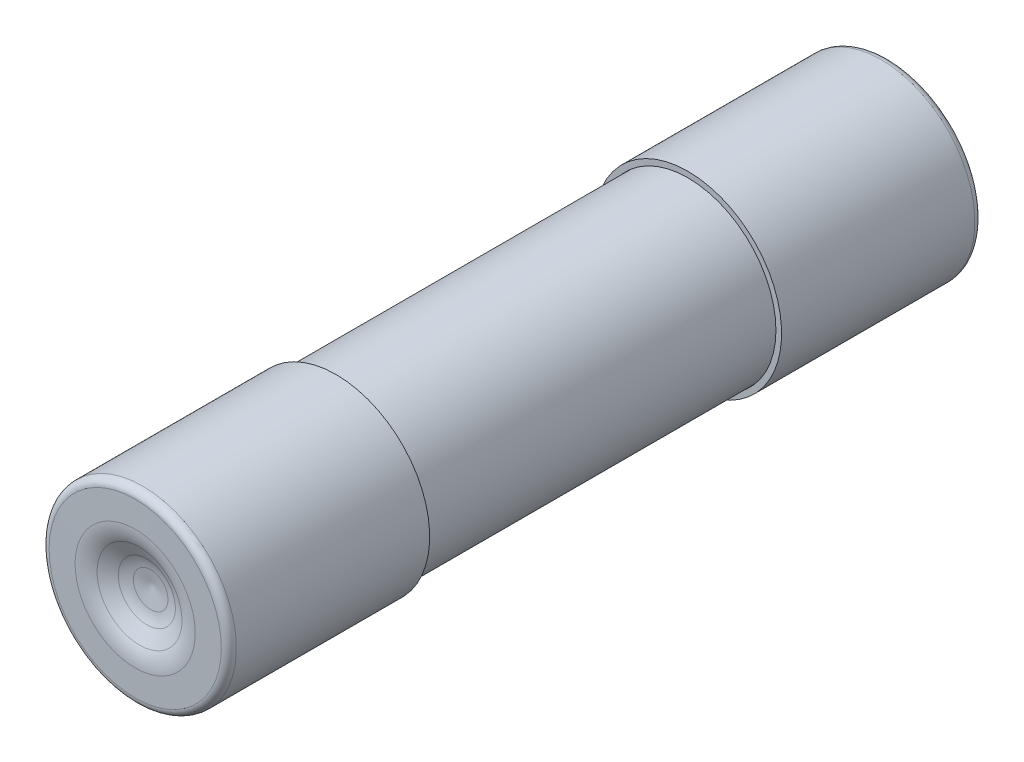
ISO-10303-21;
HEADER;
FILE_DESCRIPTION(('STEP AP214'),'2;1');
FILE_NAME('part.step','',(''),(''),'','','');
FILE_SCHEMA(('AUTOMOTIVE_DESIGN { 1 0 10303 214 1 1 1 1 }'));
ENDSEC;
DATA;
#1=APPLICATION_CONTEXT('core data for automotive mechanical design processes');
#2=APPLICATION_PROTOCOL_DEFINITION('international standard','automotive_design',2000,#1);
#3=PRODUCT_CONTEXT('',#1,'mechanical');
#4=PRODUCT('Part','Part','',(#3));
#5=PRODUCT_RELATED_PRODUCT_CATEGORY('part','',(#4));
#6=PRODUCT_DEFINITION_FORMATION('','',#4);
#7=PRODUCT_DEFINITION_CONTEXT('part definition',#1,'design');
#8=PRODUCT_DEFINITION('design','',#6,#7);
#9=PRODUCT_DEFINITION_SHAPE('','',#8);
#10=(LENGTH_UNIT() NAMED_UNIT(*) SI_UNIT(.MILLI.,.METRE.));
#11=(NAMED_UNIT(*) PLANE_ANGLE_UNIT() SI_UNIT($,.RADIAN.));
#12=(NAMED_UNIT(*) SI_UNIT($,.STERADIAN.) SOLID_ANGLE_UNIT());
#13=UNCERTAINTY_MEASURE_WITH_UNIT(LENGTH_MEASURE(1.E-05),#10,'distance_accuracy_value','');
#14=(GEOMETRIC_REPRESENTATION_CONTEXT(3) GLOBAL_UNCERTAINTY_ASSIGNED_CONTEXT((#13)) GLOBAL_UNIT_ASSIGNED_CONTEXT((#10,
#11,#12)) REPRESENTATION_CONTEXT('',''));
#15=CARTESIAN_POINT('',(0.,0.,0.));
#16=DIRECTION('',(0.,0.,1.));
#17=DIRECTION('',(1.,0.,0.));
#18=AXIS2_PLACEMENT_3D('',#15,#16,#17);
#19=CARTESIAN_POINT('',(0.,0.,19.3801475961462));
#20=DIRECTION('',(0.,0.,1.));
#21=DIRECTION('',(0.,-1.,0.));
#22=AXIS2_PLACEMENT_3D('',#19,#20,#21);
#23=DEGENERATE_TOROIDAL_SURFACE('',#22,0.0349351201433466,1.,.T.);
#24=CARTESIAN_POINT('',(0.,0.,18.3943292370881));
#25=DIRECTION('',(0.,0.,1.));
#26=DIRECTION('',(0.,-1.,0.));
#27=AXIS2_PLACEMENT_3D('',#24,#25,#26);
#28=CIRCLE('',#27,0.202750980371087);
#29=CARTESIAN_POINT('',(0.,-0.202750980371087,18.3943292370881));
#30=VERTEX_POINT('',#29);
#31=EDGE_CURVE('E12',#30,#30,#28,.T.);
#32=ORIENTED_EDGE('',*,*,#31,.F.);
#33=EDGE_LOOP('',(#32));
#34=FACE_BOUND('',#33,.T.);
#35=CARTESIAN_POINT('',(0.,0.,18.3801475961462));
#36=DIRECTION('',(0.,0.,1.));
#37=DIRECTION('',(0.,-1.,0.));
#38=AXIS2_PLACEMENT_3D('',#35,#36,#37);
#39=CIRCLE('',#38,0.0349351201433437);
#40=CARTESIAN_POINT('',(0.,-0.0349351201433436,18.3801475961462));
#41=VERTEX_POINT('',#40);
#42=EDGE_CURVE('E65',#41,#41,#39,.T.);
#43=ORIENTED_EDGE('',*,*,#42,.T.);
#44=EDGE_LOOP('',(#43));
#45=FACE_BOUND('',#44,.T.);
#46=ADVANCED_FACE('F45',(#34,#45),#23,.T.);
#47=CARTESIAN_POINT('',(0.,0.,18.3943292370881));
#48=DIRECTION('',(0.,0.,1.));
#49=DIRECTION('',(0.,-1.,0.));
#50=AXIS2_PLACEMENT_3D('',#47,#48,#49);
#51=CONICAL_SURFACE('',#50,0.202750980371087,1.40218263749149);
#52=CARTESIAN_POINT('',(0.,0.,18.4463330154933));
#53=DIRECTION('',(0.,0.,1.));
#54=DIRECTION('',(0.,-1.,0.));
#55=AXIS2_PLACEMENT_3D('',#52,#53,#54);
#56=CIRCLE('',#55,0.508242245753945);
#57=CARTESIAN_POINT('',(0.,-0.508242245753945,18.4463330154933));
#58=VERTEX_POINT('',#57);
#59=EDGE_CURVE('E51',#58,#58,#56,.T.);
#60=ORIENTED_EDGE('',*,*,#59,.F.);
#61=EDGE_LOOP('',(#60));
#62=FACE_BOUND('',#61,.T.);
#63=ORIENTED_EDGE('',*,*,#31,.T.);
#64=EDGE_LOOP('',(#63));
#65=FACE_BOUND('',#64,.T.);
#66=ADVANCED_FACE('F109',(#62,#65),#51,.T.);
#67=CARTESIAN_POINT('',(0.,0.,19.4321513745514));
#68=DIRECTION('',(0.,0.,1.));
#69=DIRECTION('',(0.,-1.,0.));
#70=AXIS2_PLACEMENT_3D('',#67,#68,#69);
#71=DEGENERATE_TOROIDAL_SURFACE('',#70,0.34042638552621,1.,.T.);
#72=CARTESIAN_POINT('',(0.,0.,18.5473246046598));
#73=DIRECTION('',(0.,0.,1.));
#74=DIRECTION('',(0.,-1.,0.));
#75=AXIS2_PLACEMENT_3D('',#72,#73,#74);
#76=CIRCLE('',#75,0.806346536714317);
#77=CARTESIAN_POINT('',(0.,-0.806346536714317,18.5473246046598));
#78=VERTEX_POINT('',#77);
#79=EDGE_CURVE('E102',#78,#78,#76,.T.);
#80=ORIENTED_EDGE('',*,*,#79,.F.);
#81=EDGE_LOOP('',(#80));
#82=FACE_BOUND('',#81,.T.);
#83=ORIENTED_EDGE('',*,*,#59,.T.);
#84=EDGE_LOOP('',(#83));
#85=FACE_BOUND('',#84,.T.);
#86=ADVANCED_FACE('F107',(#82,#85),#71,.T.);
#87=CARTESIAN_POINT('',(0.,0.,18.5473246046598));
#88=DIRECTION('',(0.,0.,1.));
#89=DIRECTION('',(0.,-1.,0.));
#90=AXIS2_PLACEMENT_3D('',#87,#88,#89);
#91=CONICAL_SURFACE('',#90,0.806346536714317,1.08612207754713);
#92=CARTESIAN_POINT('',(0.,0.,18.7348267698916));
#93=DIRECTION('',(0.,0.,1.));
#94=DIRECTION('',(0.,-1.,0.));
#95=AXIS2_PLACEMENT_3D('',#92,#93,#94);
#96=CIRCLE('',#95,1.16243101768532);
#97=CARTESIAN_POINT('',(0.,-1.16243101768532,18.7348267698916));
#98=VERTEX_POINT('',#97);
#99=EDGE_CURVE('E99',#98,#98,#96,.T.);
#100=ORIENTED_EDGE('',*,*,#99,.F.);
#101=EDGE_LOOP('',(#100));
#102=FACE_BOUND('',#101,.T.);
#103=ORIENTED_EDGE('',*,*,#79,.T.);
#104=EDGE_LOOP('',(#103));
#105=FACE_BOUND('',#104,.T.);
#106=ADVANCED_FACE('F164',(#102,#105),#91,.T.);
#107=CARTESIAN_POINT('',(0.,0.,17.85));
#108=DIRECTION('',(0.,0.,1.));
#109=DIRECTION('',(0.,-1.,0.));
#110=AXIS2_PLACEMENT_3D('',#107,#108,#109);
#111=TOROIDAL_SURFACE('',#110,1.62835116887342,0.999999999999997);
#112=CARTESIAN_POINT('',(0.,0.,18.85));
#113=DIRECTION('',(0.,0.,1.));
#114=DIRECTION('',(0.,-1.,0.));
#115=AXIS2_PLACEMENT_3D('',#112,#113,#114);
#116=CIRCLE('',#115,1.62835116887343);
#117=CARTESIAN_POINT('',(0.,-1.62835116887343,18.85));
#118=VERTEX_POINT('',#117);
#119=EDGE_CURVE('E96',#118,#118,#116,.T.);
#120=ORIENTED_EDGE('',*,*,#119,.F.);
#121=EDGE_LOOP('',(#120));
#122=FACE_BOUND('',#121,.T.);
#123=ORIENTED_EDGE('',*,*,#99,.T.);
#124=EDGE_LOOP('',(#123));
#125=FACE_BOUND('',#124,.T.);
#126=ADVANCED_FACE('F160',(#122,#125),#111,.F.);
#127=CARTESIAN_POINT('',(0.,2.285,18.85));
#128=DIRECTION('',(0.,0.,1.));
#129=DIRECTION('',(0.,-1.,0.));
#130=AXIS2_PLACEMENT_3D('',#127,#128,#129);
#131=PLANE('',#130);
#132=CARTESIAN_POINT('',(0.,0.,18.85));
#133=DIRECTION('',(0.,0.,1.));
#134=DIRECTION('',(0.,-1.,0.));
#135=AXIS2_PLACEMENT_3D('',#132,#133,#134);
#136=CIRCLE('',#135,2.285);
#137=CARTESIAN_POINT('',(0.,-2.285,18.85));
#138=VERTEX_POINT('',#137);
#139=EDGE_CURVE('E93',#138,#138,#136,.T.);
#140=ORIENTED_EDGE('',*,*,#139,.F.);
#141=EDGE_LOOP('',(#140));
#142=FACE_BOUND('',#141,.T.);
#143=ORIENTED_EDGE('',*,*,#119,.T.);
#144=EDGE_LOOP('',(#143));
#145=FACE_BOUND('',#144,.T.);
#146=ADVANCED_FACE('F156',(#142,#145),#131,.F.);
#147=CARTESIAN_POINT('',(0.,0.,18.8));
#148=DIRECTION('',(0.,0.,1.));
#149=DIRECTION('',(0.,-1.,0.));
#150=AXIS2_PLACEMENT_3D('',#147,#148,#149);
#151=TOROIDAL_SURFACE('',#150,2.285,0.049999999999999);
#152=CARTESIAN_POINT('',(0.,0.,18.8));
#153=DIRECTION('',(0.,0.,1.));
#154=DIRECTION('',(0.,-1.,0.));
#155=AXIS2_PLACEMENT_3D('',#152,#153,#154);
#156=CIRCLE('',#155,2.335);
#157=CARTESIAN_POINT('',(0.,-2.335,18.8));
#158=VERTEX_POINT('',#157);
#159=EDGE_CURVE('E90',#158,#158,#156,.T.);
#160=ORIENTED_EDGE('',*,*,#159,.F.);
#161=EDGE_LOOP('',(#160));
#162=FACE_BOUND('',#161,.T.);
#163=ORIENTED_EDGE('',*,*,#139,.T.);
#164=EDGE_LOOP('',(#163));
#165=FACE_BOUND('',#164,.T.);
#166=ADVANCED_FACE('F152',(#162,#165),#151,.F.);
#167=CARTESIAN_POINT('',(0.,0.,19.5807429338047));
#168=DIRECTION('',(0.,0.,1.));
#169=DIRECTION('',(0.,-1.,0.));
#170=AXIS2_PLACEMENT_3D('',#167,#168,#169);
#171=CYLINDRICAL_SURFACE('',#170,2.335);
#172=CARTESIAN_POINT('',(0.,0.,13.67));
#173=DIRECTION('',(0.,0.,1.));
#174=DIRECTION('',(0.,-1.,0.));
#175=AXIS2_PLACEMENT_3D('',#172,#173,#174);
#176=CIRCLE('',#175,2.335);
#177=CARTESIAN_POINT('',(0.,-2.335,13.67));
#178=VERTEX_POINT('',#177);
#179=EDGE_CURVE('E87',#178,#178,#176,.T.);
#180=ORIENTED_EDGE('',*,*,#179,.F.);
#181=EDGE_LOOP('',(#180));
#182=FACE_BOUND('',#181,.T.);
#183=ORIENTED_EDGE('',*,*,#159,.T.);
#184=EDGE_LOOP('',(#183));
#185=FACE_BOUND('',#184,.T.);
#186=ADVANCED_FACE('F148',(#182,#185),#171,.F.);
#187=CARTESIAN_POINT('',(0.,2.485,13.67));
#188=DIRECTION('',(0.,0.,1.));
#189=DIRECTION('',(0.,-1.,0.));
#190=AXIS2_PLACEMENT_3D('',#187,#188,#189);
#191=PLANE('',#190);
#192=CARTESIAN_POINT('',(0.,0.,13.67));
#193=DIRECTION('',(0.,0.,1.));
#194=DIRECTION('',(0.,-1.,0.));
#195=AXIS2_PLACEMENT_3D('',#192,#193,#194);
#196=CIRCLE('',#195,2.485);
#197=CARTESIAN_POINT('',(0.,-2.485,13.67));
#198=VERTEX_POINT('',#197);
#199=EDGE_CURVE('E84',#198,#198,#196,.T.);
#200=ORIENTED_EDGE('',*,*,#199,.F.);
#201=EDGE_LOOP('',(#200));
#202=FACE_BOUND('',#201,.T.);
#203=ORIENTED_EDGE('',*,*,#179,.T.);
#204=EDGE_LOOP('',(#203));
#205=FACE_BOUND('',#204,.T.);
#206=ADVANCED_FACE('F144',(#202,#205),#191,.F.);
#207=CARTESIAN_POINT('',(0.,0.,19.5807429338047));
#208=DIRECTION('',(0.,0.,1.));
#209=DIRECTION('',(0.,-1.,0.));
#210=AXIS2_PLACEMENT_3D('',#207,#208,#209);
#211=CYLINDRICAL_SURFACE('',#210,2.48499999999736);
#212=CARTESIAN_POINT('',(0.,0.,18.8));
#213=DIRECTION('',(0.,0.,1.));
#214=DIRECTION('',(0.,-1.,0.));
#215=AXIS2_PLACEMENT_3D('',#212,#213,#214);
#216=CIRCLE('',#215,2.48499999999471);
#217=CARTESIAN_POINT('',(0.,-2.48499999999471,18.8));
#218=VERTEX_POINT('',#217);
#219=EDGE_CURVE('E81',#218,#218,#216,.T.);
#220=ORIENTED_EDGE('',*,*,#219,.F.);
#221=EDGE_LOOP('',(#220));
#222=FACE_BOUND('',#221,.T.);
#223=ORIENTED_EDGE('',*,*,#199,.T.);
#224=EDGE_LOOP('',(#223));
#225=FACE_BOUND('',#224,.T.);
#226=ADVANCED_FACE('F140',(#222,#225),#211,.T.);
#227=CARTESIAN_POINT('',(0.,0.,18.8));
#228=DIRECTION('',(0.,0.,1.));
#229=DIRECTION('',(0.,-1.,0.));
#230=AXIS2_PLACEMENT_3D('',#227,#228,#229);
#231=TOROIDAL_SURFACE('',#230,2.285,0.199999999994713);
#232=CARTESIAN_POINT('',(0.,0.,18.9999997743625));
#233=DIRECTION('',(0.,0.,1.));
#234=DIRECTION('',(0.,-1.,0.));
#235=AXIS2_PLACEMENT_3D('',#232,#233,#234);
#236=CIRCLE('',#235,2.28530042459849);
#237=CARTESIAN_POINT('',(0.,-2.28530042459849,18.9999997743625));
#238=VERTEX_POINT('',#237);
#239=EDGE_CURVE('E78',#238,#238,#236,.T.);
#240=ORIENTED_EDGE('',*,*,#239,.F.);
#241=EDGE_LOOP('',(#240));
#242=FACE_BOUND('',#241,.T.);
#243=ORIENTED_EDGE('',*,*,#219,.T.);
#244=EDGE_LOOP('',(#243));
#245=FACE_BOUND('',#244,.T.);
#246=ADVANCED_FACE('F136',(#242,#245),#231,.T.);
#247=CARTESIAN_POINT('',(0.,0.,18.9999997743625));
#248=DIRECTION('',(0.,0.,-1.));
#249=DIRECTION('',(0.,1.,0.));
#250=AXIS2_PLACEMENT_3D('',#247,#248,#249);
#251=CONICAL_SURFACE('',#250,2.28530042459849,1.56929420318464);
#252=CARTESIAN_POINT('',(0.,0.,19.0010370737667));
#253=DIRECTION('',(0.,0.,1.));
#254=DIRECTION('',(0.,-1.,0.));
#255=AXIS2_PLACEMENT_3D('',#252,#253,#254);
#256=CIRCLE('',#255,1.59474565471326);
#257=CARTESIAN_POINT('',(0.,-1.59474565471326,19.0010370737667));
#258=VERTEX_POINT('',#257);
#259=EDGE_CURVE('E75',#258,#258,#256,.T.);
#260=ORIENTED_EDGE('',*,*,#259,.F.);
#261=EDGE_LOOP('',(#260));
#262=FACE_BOUND('',#261,.T.);
#263=ORIENTED_EDGE('',*,*,#239,.T.);
#264=EDGE_LOOP('',(#263));
#265=FACE_BOUND('',#264,.T.);
#266=ADVANCED_FACE('F132',(#262,#265),#251,.T.);
#267=CARTESIAN_POINT('',(0.,0.,18.0010382019542));
#268=DIRECTION('',(0.,0.,1.));
#269=DIRECTION('',(0.,-1.,0.));
#270=AXIS2_PLACEMENT_3D('',#267,#268,#269);
#271=TOROIDAL_SURFACE('',#270,1.5932435316679,1.);
#272=CARTESIAN_POINT('',(0.,0.,18.8858649718458));
#273=DIRECTION('',(0.,0.,1.));
#274=DIRECTION('',(0.,-1.,0.));
#275=AXIS2_PLACEMENT_3D('',#272,#273,#274);
#276=CIRCLE('',#275,1.1273233804798);
#277=CARTESIAN_POINT('',(0.,-1.1273233804798,18.8858649718458));
#278=VERTEX_POINT('',#277);
#279=EDGE_CURVE('E68',#278,#278,#276,.T.);
#280=ORIENTED_EDGE('',*,*,#279,.F.);
#281=EDGE_LOOP('',(#280));
#282=FACE_BOUND('',#281,.T.);
#283=ORIENTED_EDGE('',*,*,#259,.T.);
#284=EDGE_LOOP('',(#283));
#285=FACE_BOUND('',#284,.T.);
#286=ADVANCED_FACE('F128',(#282,#285),#271,.T.);
#287=CARTESIAN_POINT('',(0.,0.,18.8858649718458));
#288=DIRECTION('',(0.,0.,1.));
#289=DIRECTION('',(0.,-1.,0.));
#290=AXIS2_PLACEMENT_3D('',#287,#288,#289);
#291=CONICAL_SURFACE('',#290,1.1273233804798,1.08612207754713);
#292=CARTESIAN_POINT('',(0.,0.,18.6911859112977));
#293=DIRECTION('',(0.,0.,1.));
#294=DIRECTION('',(0.,-1.,0.));
#295=AXIS2_PLACEMENT_3D('',#292,#293,#294);
#296=CIRCLE('',#295,0.757609291335807);
#297=CARTESIAN_POINT('',(0.,-0.757609291335807,18.6911859112977));
#298=VERTEX_POINT('',#297);
#299=EDGE_CURVE('E64',#298,#298,#296,.T.);
#300=ORIENTED_EDGE('',*,*,#299,.F.);
#301=EDGE_LOOP('',(#300));
#302=FACE_BOUND('',#301,.T.);
#303=ORIENTED_EDGE('',*,*,#279,.T.);
#304=EDGE_LOOP('',(#303));
#305=FACE_BOUND('',#304,.T.);
#306=ADVANCED_FACE('F125',(#302,#305),#291,.F.);
#307=CARTESIAN_POINT('',(0.,0.,19.5760126811893));
#308=DIRECTION('',(0.,0.,1.));
#309=DIRECTION('',(0.,-1.,0.));
#310=AXIS2_PLACEMENT_3D('',#307,#308,#309);
#311=DEGENERATE_TOROIDAL_SURFACE('',#310,0.291689140147699,1.,.T.);
#312=CARTESIAN_POINT('',(0.,0.,18.5901943221312));
#313=DIRECTION('',(0.,0.,1.));
#314=DIRECTION('',(0.,-1.,0.));
#315=AXIS2_PLACEMENT_3D('',#312,#313,#314);
#316=CIRCLE('',#315,0.459505000375436);
#317=CARTESIAN_POINT('',(0.,-0.459505000375436,18.5901943221312));
#318=VERTEX_POINT('',#317);
#319=EDGE_CURVE('E62',#318,#318,#316,.T.);
#320=ORIENTED_EDGE('',*,*,#319,.F.);
#321=EDGE_LOOP('',(#320));
#322=FACE_BOUND('',#321,.T.);
#323=ORIENTED_EDGE('',*,*,#299,.T.);
#324=EDGE_LOOP('',(#323));
#325=FACE_BOUND('',#324,.T.);
#326=ADVANCED_FACE('F58',(#322,#325),#311,.F.);
#327=CARTESIAN_POINT('',(0.,0.,18.5901943221312));
#328=DIRECTION('',(0.,0.,1.));
#329=DIRECTION('',(0.,-1.,0.));
#330=AXIS2_PLACEMENT_3D('',#327,#328,#329);
#331=CONICAL_SURFACE('',#330,0.459505000375436,1.40218263749149);
#332=CARTESIAN_POINT('',(0.,0.,18.5119727854673));
#333=VERTEX_POINT('',#332);
#334=VERTEX_LOOP('',#333);
#335=FACE_BOUND('',#334,.T.);
#336=ORIENTED_EDGE('',*,*,#319,.T.);
#337=EDGE_LOOP('',(#336));
#338=FACE_BOUND('',#337,.T.);
#339=ADVANCED_FACE('F54',(#335,#338),#331,.F.);
#340=CARTESIAN_POINT('',(0.,0.,18.3801475961462));
#341=DIRECTION('',(0.,0.,1.));
#342=DIRECTION('',(0.,-1.,0.));
#343=AXIS2_PLACEMENT_3D('',#340,#341,#342);
#344=PLANE('',#343);
#345=ORIENTED_EDGE('',*,*,#42,.F.);
#346=EDGE_LOOP('',(#345));
#347=FACE_BOUND('',#346,.T.);
#348=ADVANCED_FACE('F57',(#347),#344,.F.);
#349=CLOSED_SHELL('',(#46,#66,#86,#106,#126,#146,#166,#186,#206,#226,#246,#266,#286,#306,#326,
#339,#348));
#350=MANIFOLD_SOLID_BREP('B2',#349);
#351=CARTESIAN_POINT('',(0.,2.485,4.33));
#352=DIRECTION('',(0.,0.,-1.));
#353=DIRECTION('',(0.,1.,0.));
#354=AXIS2_PLACEMENT_3D('',#351,#352,#353);
#355=PLANE('',#354);
#356=CARTESIAN_POINT('',(0.,0.,4.33));
#357=DIRECTION('',(0.,0.,1.));
#358=DIRECTION('',(0.,-1.,0.));
#359=AXIS2_PLACEMENT_3D('',#356,#357,#358);
#360=CIRCLE('',#359,2.335);
#361=CARTESIAN_POINT('',(0.,-2.335,4.33));
#362=VERTEX_POINT('',#361);
#363=EDGE_CURVE('E341',#362,#362,#360,.T.);
#364=ORIENTED_EDGE('',*,*,#363,.F.);
#365=EDGE_LOOP('',(#364));
#366=FACE_BOUND('',#365,.T.);
#367=CARTESIAN_POINT('',(0.,0.,4.33));
#368=DIRECTION('',(0.,0.,1.));
#369=DIRECTION('',(0.,-1.,0.));
#370=AXIS2_PLACEMENT_3D('',#367,#368,#369);
#371=CIRCLE('',#370,2.485);
#372=CARTESIAN_POINT('',(0.,-2.485,4.33));
#373=VERTEX_POINT('',#372);
#374=EDGE_CURVE('E43',#373,#373,#371,.T.);
#375=ORIENTED_EDGE('',*,*,#374,.T.);
#376=EDGE_LOOP('',(#375));
#377=FACE_BOUND('',#376,.T.);
#378=ADVANCED_FACE('F304',(#366,#377),#355,.F.);
#379=CARTESIAN_POINT('',(0.,0.,19.5807429338047));
#380=DIRECTION('',(0.,0.,1.));
#381=DIRECTION('',(0.,-1.,0.));
#382=AXIS2_PLACEMENT_3D('',#379,#380,#381);
#383=CYLINDRICAL_SURFACE('',#382,2.48499999999472);
#384=ORIENTED_EDGE('',*,*,#374,.F.);
#385=EDGE_LOOP('',(#384));
#386=FACE_BOUND('',#385,.T.);
#387=CARTESIAN_POINT('',(0.,0.,-0.799999999999995));
#388=DIRECTION('',(0.,0.,1.));
#389=DIRECTION('',(0.,-1.,0.));
#390=AXIS2_PLACEMENT_3D('',#387,#388,#389);
#391=CIRCLE('',#390,2.48499999998944);
#392=CARTESIAN_POINT('',(0.,-2.48499999998944,-0.799999999999995));
#393=VERTEX_POINT('',#392);
#394=EDGE_CURVE('E310',#393,#393,#391,.T.);
#395=ORIENTED_EDGE('',*,*,#394,.T.);
#396=EDGE_LOOP('',(#395));
#397=FACE_BOUND('',#396,.T.);
#398=ADVANCED_FACE('F331',(#386,#397),#383,.T.);
#399=CARTESIAN_POINT('',(0.,0.,-0.799999999999984));
#400=DIRECTION('',(0.,0.,1.));
#401=DIRECTION('',(0.,-1.,0.));
#402=AXIS2_PLACEMENT_3D('',#399,#400,#401);
#403=TOROIDAL_SURFACE('',#402,2.285,0.199999999994721);
#404=ORIENTED_EDGE('',*,*,#394,.F.);
#405=EDGE_LOOP('',(#404));
#406=FACE_BOUND('',#405,.T.);
#407=CARTESIAN_POINT('',(0.,0.,-0.999999774357229));
#408=DIRECTION('',(0.,0.,1.));
#409=DIRECTION('',(0.,-1.,0.));
#410=AXIS2_PLACEMENT_3D('',#407,#408,#409);
#411=CIRCLE('',#410,2.28530042459848);
#412=CARTESIAN_POINT('',(0.,-2.28530042459848,-0.999999774357229));
#413=VERTEX_POINT('',#412);
#414=EDGE_CURVE('E347',#413,#413,#411,.T.);
#415=ORIENTED_EDGE('',*,*,#414,.T.);
#416=EDGE_LOOP('',(#415));
#417=FACE_BOUND('',#416,.T.);
#418=ADVANCED_FACE('F336',(#406,#417),#403,.T.);
#419=CARTESIAN_POINT('',(0.,0.,-1.00103707376671));
#420=DIRECTION('',(0.,0.,1.));
#421=DIRECTION('',(0.,-1.,0.));
#422=AXIS2_PLACEMENT_3D('',#419,#420,#421);
#423=CONICAL_SURFACE('',#422,1.59474565471325,1.56929420317699);
#424=ORIENTED_EDGE('',*,*,#414,.F.);
#425=EDGE_LOOP('',(#424));
#426=FACE_BOUND('',#425,.T.);
#427=CARTESIAN_POINT('',(0.,0.,-1.00103707376671));
#428=DIRECTION('',(0.,0.,1.));
#429=DIRECTION('',(0.,-1.,0.));
#430=AXIS2_PLACEMENT_3D('',#427,#428,#429);
#431=CIRCLE('',#430,1.59474565471325);
#432=CARTESIAN_POINT('',(0.,-1.59474565471325,-1.00103707376671));
#433=VERTEX_POINT('',#432);
#434=EDGE_CURVE('E349',#433,#433,#431,.T.);
#435=ORIENTED_EDGE('',*,*,#434,.T.);
#436=EDGE_LOOP('',(#435));
#437=FACE_BOUND('',#436,.T.);
#438=ADVANCED_FACE('F541',(#426,#437),#423,.T.);
#439=CARTESIAN_POINT('',(0.,0.,-0.0010382019541694));
#440=DIRECTION('',(0.,0.,1.));
#441=DIRECTION('',(0.,-1.,0.));
#442=AXIS2_PLACEMENT_3D('',#439,#440,#441);
#443=TOROIDAL_SURFACE('',#442,1.5932435316679,1.);
#444=ORIENTED_EDGE('',*,*,#434,.F.);
#445=EDGE_LOOP('',(#444));
#446=FACE_BOUND('',#445,.T.);
#447=CARTESIAN_POINT('',(0.,0.,-0.885864971845798));
#448=DIRECTION('',(0.,0.,1.));
#449=DIRECTION('',(0.,-1.,0.));
#450=AXIS2_PLACEMENT_3D('',#447,#448,#449);
#451=CIRCLE('',#450,1.12732338047979);
#452=CARTESIAN_POINT('',(0.,-1.12732338047979,-0.885864971845798));
#453=VERTEX_POINT('',#452);
#454=EDGE_CURVE('E354',#453,#453,#451,.T.);
#455=ORIENTED_EDGE('',*,*,#454,.T.);
#456=EDGE_LOOP('',(#455));
#457=FACE_BOUND('',#456,.T.);
#458=ADVANCED_FACE('F532',(#446,#457),#443,.T.);
#459=CARTESIAN_POINT('',(0.,0.,-0.691185911297666));
#460=DIRECTION('',(0.,0.,-1.));
#461=DIRECTION('',(0.,1.,0.));
#462=AXIS2_PLACEMENT_3D('',#459,#460,#461);
#463=CONICAL_SURFACE('',#462,0.757609291335803,1.08612207754713);
#464=ORIENTED_EDGE('',*,*,#454,.F.);
#465=EDGE_LOOP('',(#464));
#466=FACE_BOUND('',#465,.T.);
#467=CARTESIAN_POINT('',(0.,0.,-0.691185911297666));
#468=DIRECTION('',(0.,0.,1.));
#469=DIRECTION('',(0.,-1.,0.));
#470=AXIS2_PLACEMENT_3D('',#467,#468,#469);
#471=CIRCLE('',#470,0.757609291335803);
#472=CARTESIAN_POINT('',(0.,-0.757609291335801,-0.691185911297666));
#473=VERTEX_POINT('',#472);
#474=EDGE_CURVE('E357',#473,#473,#471,.T.);
#475=ORIENTED_EDGE('',*,*,#474,.T.);
#476=EDGE_LOOP('',(#475));
#477=FACE_BOUND('',#476,.T.);
#478=ADVANCED_FACE('F326',(#466,#477),#463,.F.);
#479=CARTESIAN_POINT('',(0.,0.,-1.57601268118929));
#480=DIRECTION('',(0.,0.,1.));
#481=DIRECTION('',(0.,-1.,0.));
#482=AXIS2_PLACEMENT_3D('',#479,#480,#481);
#483=DEGENERATE_TOROIDAL_SURFACE('',#482,0.291689140147695,1.,.T.);
#484=ORIENTED_EDGE('',*,*,#474,.F.);
#485=EDGE_LOOP('',(#484));
#486=FACE_BOUND('',#485,.T.);
#487=CARTESIAN_POINT('',(0.,0.,-0.590194322131182));
#488=DIRECTION('',(0.,0.,1.));
#489=DIRECTION('',(0.,-1.,0.));
#490=AXIS2_PLACEMENT_3D('',#487,#488,#489);
#491=CIRCLE('',#490,0.459505000375433);
#492=CARTESIAN_POINT('',(0.,-0.459505000375431,-0.590194322131182));
#493=VERTEX_POINT('',#492);
#494=EDGE_CURVE('E360',#493,#493,#491,.T.);
#495=ORIENTED_EDGE('',*,*,#494,.T.);
#496=EDGE_LOOP('',(#495));
#497=FACE_BOUND('',#496,.T.);
#498=ADVANCED_FACE('F316',(#486,#497),#483,.F.);
#499=CARTESIAN_POINT('',(0.,0.,-0.51197278546734));
#500=DIRECTION('',(0.,0.,-1.));
#501=DIRECTION('',(0.,1.,0.));
#502=AXIS2_PLACEMENT_3D('',#499,#500,#501);
#503=CONICAL_SURFACE('',#502,0.,1.40218263749148);
#504=ORIENTED_EDGE('',*,*,#494,.F.);
#505=EDGE_LOOP('',(#504));
#506=FACE_BOUND('',#505,.T.);
#507=CARTESIAN_POINT('',(0.,0.,-0.511972785467341));
#508=VERTEX_POINT('',#507);
#509=VERTEX_LOOP('',#508);
#510=FACE_BOUND('',#509,.T.);
#511=ADVANCED_FACE('F313',(#506,#510),#503,.F.);
#512=CARTESIAN_POINT('',(0.,0.,-1.3801475961462));
#513=DIRECTION('',(0.,0.,1.));
#514=DIRECTION('',(0.,-1.,0.));
#515=AXIS2_PLACEMENT_3D('',#512,#513,#514);
#516=DEGENERATE_TOROIDAL_SURFACE('',#515,0.0349351201433415,1.,.T.);
#517=CARTESIAN_POINT('',(0.,0.,-0.380147596146196));
#518=DIRECTION('',(0.,0.,1.));
#519=DIRECTION('',(0.,-1.,0.));
#520=AXIS2_PLACEMENT_3D('',#517,#518,#519);
#521=CIRCLE('',#520,0.0349351201433387);
#522=CARTESIAN_POINT('',(0.,-0.0349351201433371,-0.380147596146196));
#523=VERTEX_POINT('',#522);
#524=EDGE_CURVE('E363',#523,#523,#521,.T.);
#525=ORIENTED_EDGE('',*,*,#524,.F.);
#526=EDGE_LOOP('',(#525));
#527=FACE_BOUND('',#526,.T.);
#528=CARTESIAN_POINT('',(0.,0.,-0.394329237088088));
#529=DIRECTION('',(0.,0.,1.));
#530=DIRECTION('',(0.,-1.,0.));
#531=AXIS2_PLACEMENT_3D('',#528,#529,#530);
#532=CIRCLE('',#531,0.202750980371084);
#533=CARTESIAN_POINT('',(0.,-0.202750980371082,-0.394329237088088));
#534=VERTEX_POINT('',#533);
#535=EDGE_CURVE('E366',#534,#534,#532,.T.);
#536=ORIENTED_EDGE('',*,*,#535,.T.);
#537=EDGE_LOOP('',(#536));
#538=FACE_BOUND('',#537,.T.);
#539=ADVANCED_FACE('F315',(#527,#538),#516,.T.);
#540=CARTESIAN_POINT('',(0.,0.,-0.446333015493339));
#541=DIRECTION('',(0.,0.,-1.));
#542=DIRECTION('',(0.,1.,0.));
#543=AXIS2_PLACEMENT_3D('',#540,#541,#542);
#544=CONICAL_SURFACE('',#543,0.508242245753942,1.40218263749148);
#545=ORIENTED_EDGE('',*,*,#535,.F.);
#546=EDGE_LOOP('',(#545));
#547=FACE_BOUND('',#546,.T.);
#548=CARTESIAN_POINT('',(0.,0.,-0.446333015493339));
#549=DIRECTION('',(0.,0.,1.));
#550=DIRECTION('',(0.,-1.,0.));
#551=AXIS2_PLACEMENT_3D('',#548,#549,#550);
#552=CIRCLE('',#551,0.508242245753942);
#553=CARTESIAN_POINT('',(0.,-0.508242245753941,-0.446333015493339));
#554=VERTEX_POINT('',#553);
#555=EDGE_CURVE('E369',#554,#554,#552,.T.);
#556=ORIENTED_EDGE('',*,*,#555,.T.);
#557=EDGE_LOOP('',(#556));
#558=FACE_BOUND('',#557,.T.);
#559=ADVANCED_FACE('F323',(#547,#558),#544,.T.);
#560=CARTESIAN_POINT('',(0.,0.,-1.43215137455145));
#561=DIRECTION('',(0.,0.,1.));
#562=DIRECTION('',(0.,-1.,0.));
#563=AXIS2_PLACEMENT_3D('',#560,#561,#562);
#564=DEGENERATE_TOROIDAL_SURFACE('',#563,0.340426385526207,1.,.T.);
#565=ORIENTED_EDGE('',*,*,#555,.F.);
#566=EDGE_LOOP('',(#565));
#567=FACE_BOUND('',#566,.T.);
#568=CARTESIAN_POINT('',(0.,0.,-0.547324604659821));
#569=DIRECTION('',(0.,0.,1.));
#570=DIRECTION('',(0.,-1.,0.));
#571=AXIS2_PLACEMENT_3D('',#568,#569,#570);
#572=CIRCLE('',#571,0.806346536714314);
#573=CARTESIAN_POINT('',(0.,-0.806346536714313,-0.547324604659821));
#574=VERTEX_POINT('',#573);
#575=EDGE_CURVE('E372',#574,#574,#572,.T.);
#576=ORIENTED_EDGE('',*,*,#575,.T.);
#577=EDGE_LOOP('',(#576));
#578=FACE_BOUND('',#577,.T.);
#579=ADVANCED_FACE('F431',(#567,#578),#564,.T.);
#580=CARTESIAN_POINT('',(0.,0.,-0.734826769891627));
#581=DIRECTION('',(0.,0.,-1.));
#582=DIRECTION('',(0.,1.,0.));
#583=AXIS2_PLACEMENT_3D('',#580,#581,#582);
#584=CONICAL_SURFACE('',#583,1.16243101768531,1.08612207754713);
#585=ORIENTED_EDGE('',*,*,#575,.F.);
#586=EDGE_LOOP('',(#585));
#587=FACE_BOUND('',#586,.T.);
#588=CARTESIAN_POINT('',(0.,0.,-0.734826769891627));
#589=DIRECTION('',(0.,0.,1.));
#590=DIRECTION('',(0.,-1.,0.));
#591=AXIS2_PLACEMENT_3D('',#588,#589,#590);
#592=CIRCLE('',#591,1.16243101768531);
#593=CARTESIAN_POINT('',(0.,-1.16243101768531,-0.734826769891627));
#594=VERTEX_POINT('',#593);
#595=EDGE_CURVE('E375',#594,#594,#592,.T.);
#596=ORIENTED_EDGE('',*,*,#595,.T.);
#597=EDGE_LOOP('',(#596));
#598=FACE_BOUND('',#597,.T.);
#599=ADVANCED_FACE('F427',(#587,#598),#584,.T.);
#600=CARTESIAN_POINT('',(0.,0.,0.15));
#601=DIRECTION('',(0.,0.,1.));
#602=DIRECTION('',(0.,-1.,0.));
#603=AXIS2_PLACEMENT_3D('',#600,#601,#602);
#604=TOROIDAL_SURFACE('',#603,1.62835116887342,1.);
#605=ORIENTED_EDGE('',*,*,#595,.F.);
#606=EDGE_LOOP('',(#605));
#607=FACE_BOUND('',#606,.T.);
#608=CARTESIAN_POINT('',(0.,0.,-0.85));
#609=DIRECTION('',(0.,0.,1.));
#610=DIRECTION('',(0.,-1.,0.));
#611=AXIS2_PLACEMENT_3D('',#608,#609,#610);
#612=CIRCLE('',#611,1.62835116887342);
#613=CARTESIAN_POINT('',(0.,-1.62835116887342,-0.85));
#614=VERTEX_POINT('',#613);
#615=EDGE_CURVE('E378',#614,#614,#612,.T.);
#616=ORIENTED_EDGE('',*,*,#615,.T.);
#617=EDGE_LOOP('',(#616));
#618=FACE_BOUND('',#617,.T.);
#619=ADVANCED_FACE('F423',(#607,#618),#604,.F.);
#620=CARTESIAN_POINT('',(0.,2.285,-0.85));
#621=DIRECTION('',(0.,0.,-1.));
#622=DIRECTION('',(0.,1.,0.));
#623=AXIS2_PLACEMENT_3D('',#620,#621,#622);
#624=PLANE('',#623);
#625=ORIENTED_EDGE('',*,*,#615,.F.);
#626=EDGE_LOOP('',(#625));
#627=FACE_BOUND('',#626,.T.);
#628=CARTESIAN_POINT('',(0.,0.,-0.85));
#629=DIRECTION('',(0.,0.,1.));
#630=DIRECTION('',(0.,-1.,0.));
#631=AXIS2_PLACEMENT_3D('',#628,#629,#630);
#632=CIRCLE('',#631,2.285);
#633=CARTESIAN_POINT('',(0.,-2.285,-0.85));
#634=VERTEX_POINT('',#633);
#635=EDGE_CURVE('E381',#634,#634,#632,.T.);
#636=ORIENTED_EDGE('',*,*,#635,.T.);
#637=EDGE_LOOP('',(#636));
#638=FACE_BOUND('',#637,.T.);
#639=ADVANCED_FACE('F419',(#627,#638),#624,.F.);
#640=CARTESIAN_POINT('',(0.,0.,-0.8));
#641=DIRECTION('',(0.,0.,1.));
#642=DIRECTION('',(0.,-1.,0.));
#643=AXIS2_PLACEMENT_3D('',#640,#641,#642);
#644=TOROIDAL_SURFACE('',#643,2.285,0.0500000000000001);
#645=ORIENTED_EDGE('',*,*,#635,.F.);
#646=EDGE_LOOP('',(#645));
#647=FACE_BOUND('',#646,.T.);
#648=CARTESIAN_POINT('',(0.,0.,-0.799999999999999));
#649=DIRECTION('',(0.,0.,1.));
#650=DIRECTION('',(0.,-1.,0.));
#651=AXIS2_PLACEMENT_3D('',#648,#649,#650);
#652=CIRCLE('',#651,2.335);
#653=CARTESIAN_POINT('',(0.,-2.335,-0.799999999999999));
#654=VERTEX_POINT('',#653);
#655=EDGE_CURVE('E384',#654,#654,#652,.T.);
#656=ORIENTED_EDGE('',*,*,#655,.T.);
#657=EDGE_LOOP('',(#656));
#658=FACE_BOUND('',#657,.T.);
#659=ADVANCED_FACE('F415',(#647,#658),#644,.F.);
#660=CARTESIAN_POINT('',(0.,0.,19.5807429338047));
#661=DIRECTION('',(0.,0.,1.));
#662=DIRECTION('',(0.,-1.,0.));
#663=AXIS2_PLACEMENT_3D('',#660,#661,#662);
#664=CYLINDRICAL_SURFACE('',#663,2.335);
#665=ORIENTED_EDGE('',*,*,#655,.F.);
#666=EDGE_LOOP('',(#665));
#667=FACE_BOUND('',#666,.T.);
#668=ORIENTED_EDGE('',*,*,#363,.T.);
#669=EDGE_LOOP('',(#668));
#670=FACE_BOUND('',#669,.T.);
#671=ADVANCED_FACE('F400',(#667,#670),#664,.F.);
#672=CARTESIAN_POINT('',(0.,-0.0349351201433371,18.4198524038538));
#673=DIRECTION('',(0.,0.,-1.));
#674=DIRECTION('',(-1.,0.,0.));
#675=AXIS2_PLACEMENT_3D('',#672,#673,#674);
#676=CYLINDRICAL_SURFACE('',#675,0.0972307246769333);
#677=CARTESIAN_POINT('',(0.,-0.0349351201433371,18.4198524038538));
#678=DIRECTION('',(0.,0.,1.));
#679=DIRECTION('',(1.,0.,0.));
#680=AXIS2_PLACEMENT_3D('',#677,#678,#679);
#681=CIRCLE('',#680,0.0972307246769333);
#682=CARTESIAN_POINT('',(0.0972307246769333,-0.0349351201433371,18.4198524038538));
#683=VERTEX_POINT('',#682);
#684=EDGE_CURVE('E388',#683,#683,#681,.T.);
#685=ORIENTED_EDGE('',*,*,#684,.F.);
#686=EDGE_LOOP('',(#685));
#687=FACE_BOUND('',#686,.T.);
#688=CARTESIAN_POINT('',(0.,-0.0349351201433371,-0.380147596146197));
#689=DIRECTION('',(0.,0.,1.));
#690=DIRECTION('',(1.,0.,0.));
#691=AXIS2_PLACEMENT_3D('',#688,#689,#690);
#692=CIRCLE('',#691,0.0972307246769333);
#693=CARTESIAN_POINT('',(0.0972307246769333,-0.0349351201433371,-0.380147596146197));
#694=VERTEX_POINT('',#693);
#695=EDGE_CURVE('E389',#694,#694,#692,.T.);
#696=ORIENTED_EDGE('',*,*,#695,.T.);
#697=EDGE_LOOP('',(#696));
#698=FACE_BOUND('',#697,.T.);
#699=ADVANCED_FACE('F397',(#687,#698),#676,.T.);
#700=CARTESIAN_POINT('',(0.,-0.0349351201433371,18.4198524038538));
#701=DIRECTION('',(0.,0.,1.));
#702=DIRECTION('',(1.,0.,0.));
#703=AXIS2_PLACEMENT_3D('',#700,#701,#702);
#704=PLANE('',#703);
#705=ORIENTED_EDGE('',*,*,#684,.T.);
#706=EDGE_LOOP('',(#705));
#707=FACE_BOUND('',#706,.T.);
#708=ADVANCED_FACE('F395',(#707),#704,.T.);
#709=CARTESIAN_POINT('',(0.,-0.0349351201433371,-0.380147596146197));
#710=DIRECTION('',(0.,0.,1.));
#711=DIRECTION('',(1.,0.,0.));
#712=AXIS2_PLACEMENT_3D('',#709,#710,#711);
#713=PLANE('',#712);
#714=ORIENTED_EDGE('',*,*,#524,.T.);
#715=EDGE_LOOP('',(#714));
#716=FACE_BOUND('',#715,.T.);
#717=ORIENTED_EDGE('',*,*,#695,.F.);
#718=EDGE_LOOP('',(#717));
#719=FACE_BOUND('',#718,.T.);
#720=ADVANCED_FACE('F404',(#716,#719),#713,.F.);
#721=CLOSED_SHELL('',(#378,#398,#418,#438,#458,#478,#498,#511,#539,#559,#579,#599,#619,#639,
#659,#671,#699,#708,#720));
#722=MANIFOLD_SOLID_BREP('B6',#721);
#723=CARTESIAN_POINT('',(0.,0.,18.));
#724=DIRECTION('',(0.,0.,1.));
#725=DIRECTION('',(1.,0.,0.));
#726=AXIS2_PLACEMENT_3D('',#723,#724,#725);
#727=PLANE('',#726);
#728=CARTESIAN_POINT('',(0.,0.,18.));
#729=DIRECTION('',(0.,0.,1.));
#730=DIRECTION('',(1.,0.,0.));
#731=AXIS2_PLACEMENT_3D('',#728,#729,#730);
#732=CIRCLE('',#731,2.33);
#733=CARTESIAN_POINT('',(2.33,0.,18.));
#734=VERTEX_POINT('',#733);
#735=EDGE_CURVE('E303',#734,#734,#732,.T.);
#736=ORIENTED_EDGE('',*,*,#735,.T.);
#737=EDGE_LOOP('',(#736));
#738=FACE_BOUND('',#737,.T.);
#739=CARTESIAN_POINT('',(0.,0.,18.));
#740=DIRECTION('',(0.,0.,1.));
#741=DIRECTION('',(1.,0.,0.));
#742=AXIS2_PLACEMENT_3D('',#739,#740,#741);
#743=CIRCLE('',#742,2.08);
#744=CARTESIAN_POINT('',(2.08,0.,18.));
#745=VERTEX_POINT('',#744);
#746=EDGE_CURVE('E597',#745,#745,#743,.T.);
#747=ORIENTED_EDGE('',*,*,#746,.F.);
#748=EDGE_LOOP('',(#747));
#749=FACE_BOUND('',#748,.T.);
#750=ADVANCED_FACE('F586',(#738,#749),#727,.T.);
#751=CARTESIAN_POINT('',(0.,0.,0.));
#752=DIRECTION('',(0.,0.,1.));
#753=DIRECTION('',(1.,0.,0.));
#754=AXIS2_PLACEMENT_3D('',#751,#752,#753);
#755=PLANE('',#754);
#756=CARTESIAN_POINT('',(0.,0.,0.));
#757=DIRECTION('',(0.,0.,1.));
#758=DIRECTION('',(1.,0.,0.));
#759=AXIS2_PLACEMENT_3D('',#756,#757,#758);
#760=CIRCLE('',#759,2.33);
#761=CARTESIAN_POINT('',(2.33,0.,0.));
#762=VERTEX_POINT('',#761);
#763=EDGE_CURVE('E590',#762,#762,#760,.T.);
#764=ORIENTED_EDGE('',*,*,#763,.F.);
#765=EDGE_LOOP('',(#764));
#766=FACE_BOUND('',#765,.T.);
#767=CARTESIAN_POINT('',(0.,0.,0.));
#768=DIRECTION('',(0.,0.,1.));
#769=DIRECTION('',(1.,0.,0.));
#770=AXIS2_PLACEMENT_3D('',#767,#768,#769);
#771=CIRCLE('',#770,2.08);
#772=CARTESIAN_POINT('',(2.08,0.,0.));
#773=VERTEX_POINT('',#772);
#774=EDGE_CURVE('E599',#773,#773,#771,.T.);
#775=ORIENTED_EDGE('',*,*,#774,.T.);
#776=EDGE_LOOP('',(#775));
#777=FACE_BOUND('',#776,.T.);
#778=ADVANCED_FACE('F609',(#766,#777),#755,.F.);
#779=CARTESIAN_POINT('',(0.,0.,18.));
#780=DIRECTION('',(0.,0.,-1.));
#781=DIRECTION('',(-1.,0.,0.));
#782=AXIS2_PLACEMENT_3D('',#779,#780,#781);
#783=CYLINDRICAL_SURFACE('',#782,2.33);
#784=ORIENTED_EDGE('',*,*,#735,.F.);
#785=EDGE_LOOP('',(#784));
#786=FACE_BOUND('',#785,.T.);
#787=ORIENTED_EDGE('',*,*,#763,.T.);
#788=EDGE_LOOP('',(#787));
#789=FACE_BOUND('',#788,.T.);
#790=ADVANCED_FACE('F588',(#786,#789),#783,.T.);
#791=CARTESIAN_POINT('',(0.,0.,18.));
#792=DIRECTION('',(0.,0.,-1.));
#793=DIRECTION('',(-1.,0.,0.));
#794=AXIS2_PLACEMENT_3D('',#791,#792,#793);
#795=CYLINDRICAL_SURFACE('',#794,2.08);
#796=ORIENTED_EDGE('',*,*,#746,.T.);
#797=EDGE_LOOP('',(#796));
#798=FACE_BOUND('',#797,.T.);
#799=ORIENTED_EDGE('',*,*,#774,.F.);
#800=EDGE_LOOP('',(#799));
#801=FACE_BOUND('',#800,.T.);
#802=ADVANCED_FACE('F605',(#798,#801),#795,.F.);
#803=CLOSED_SHELL('',(#750,#778,#790,#802));
#804=MANIFOLD_SOLID_BREP('B37',#803);
#805=ADVANCED_BREP_SHAPE_REPRESENTATION('',(#18,#350,#722,#804),#14);
#806=SHAPE_DEFINITION_REPRESENTATION(#9,#805);
ENDSEC;
END-ISO-10303-21;
